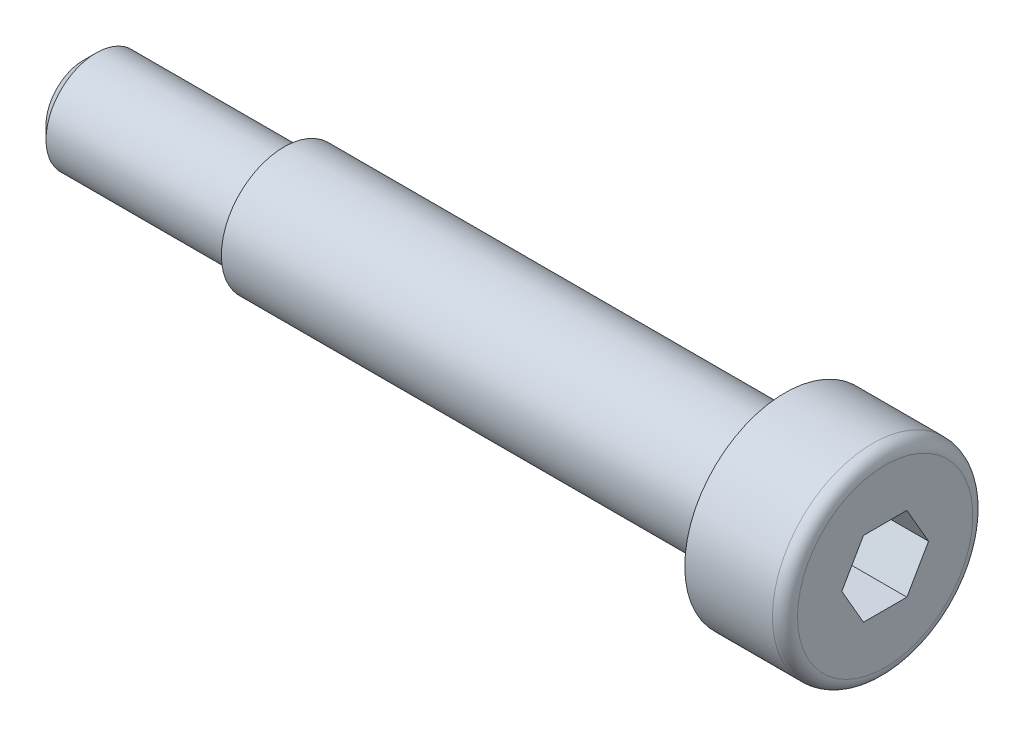
ISO-10303-21;
HEADER;
FILE_DESCRIPTION(('STEP AP214'),'2;1');
FILE_NAME('part.step','',(''),(''),'','','');
FILE_SCHEMA(('AUTOMOTIVE_DESIGN { 1 0 10303 214 1 1 1 1 }'));
ENDSEC;
DATA;
#1=APPLICATION_CONTEXT('core data for automotive mechanical design processes');
#2=APPLICATION_PROTOCOL_DEFINITION('international standard','automotive_design',2000,#1);
#3=PRODUCT_CONTEXT('',#1,'mechanical');
#4=PRODUCT('Part','Part','',(#3));
#5=PRODUCT_RELATED_PRODUCT_CATEGORY('part','',(#4));
#6=PRODUCT_DEFINITION_FORMATION('','',#4);
#7=PRODUCT_DEFINITION_CONTEXT('part definition',#1,'design');
#8=PRODUCT_DEFINITION('design','',#6,#7);
#9=PRODUCT_DEFINITION_SHAPE('','',#8);
#10=(LENGTH_UNIT() NAMED_UNIT(*) SI_UNIT(.MILLI.,.METRE.));
#11=(NAMED_UNIT(*) PLANE_ANGLE_UNIT() SI_UNIT($,.RADIAN.));
#12=(NAMED_UNIT(*) SI_UNIT($,.STERADIAN.) SOLID_ANGLE_UNIT());
#13=UNCERTAINTY_MEASURE_WITH_UNIT(LENGTH_MEASURE(1.E-05),#10,'distance_accuracy_value','');
#14=(GEOMETRIC_REPRESENTATION_CONTEXT(3) GLOBAL_UNCERTAINTY_ASSIGNED_CONTEXT((#13)) GLOBAL_UNIT_ASSIGNED_CONTEXT((#10,
#11,#12)) REPRESENTATION_CONTEXT('',''));
#15=CARTESIAN_POINT('',(0.,0.,0.));
#16=DIRECTION('',(0.,0.,1.));
#17=DIRECTION('',(1.,0.,0.));
#18=AXIS2_PLACEMENT_3D('',#15,#16,#17);
#19=CARTESIAN_POINT('',(0.,0.,0.));
#20=DIRECTION('',(-1.,0.,0.));
#21=DIRECTION('',(0.,0.,1.));
#22=AXIS2_PLACEMENT_3D('',#19,#20,#21);
#23=PLANE('',#22);
#24=DIRECTION('',(0.,0.866025403784439,0.5));
#25=VECTOR('',#24,1.);
#26=CARTESIAN_POINT('',(0.,0.,-1.73205080756888));
#27=LINE('',#26,#25);
#28=CARTESIAN_POINT('',(0.,0.,-1.73205080756888));
#29=VERTEX_POINT('',#28);
#30=CARTESIAN_POINT('',(0.,1.5,-0.866025403784438));
#31=VERTEX_POINT('',#30);
#32=EDGE_CURVE('E137',#29,#31,#27,.T.);
#33=ORIENTED_EDGE('',*,*,#32,.F.);
#34=DIRECTION('',(0.,0.866025403784439,-0.5));
#35=VECTOR('',#34,1.);
#36=CARTESIAN_POINT('',(0.,-1.5,-0.866025403784439));
#37=LINE('',#36,#35);
#38=CARTESIAN_POINT('',(0.,-1.5,-0.866025403784439));
#39=VERTEX_POINT('',#38);
#40=EDGE_CURVE('E57',#39,#29,#37,.T.);
#41=ORIENTED_EDGE('',*,*,#40,.F.);
#42=DIRECTION('',(0.,0.,-1.));
#43=VECTOR('',#42,1.);
#44=CARTESIAN_POINT('',(0.,-1.5,0.866025403784438));
#45=LINE('',#44,#43);
#46=CARTESIAN_POINT('',(0.,-1.5,0.866025403784438));
#47=VERTEX_POINT('',#46);
#48=EDGE_CURVE('E150',#47,#39,#45,.T.);
#49=ORIENTED_EDGE('',*,*,#48,.F.);
#50=DIRECTION('',(0.,-0.866025403784439,-0.5));
#51=VECTOR('',#50,1.);
#52=CARTESIAN_POINT('',(0.,0.,1.73205080756888));
#53=LINE('',#52,#51);
#54=CARTESIAN_POINT('',(0.,0.,1.73205080756888));
#55=VERTEX_POINT('',#54);
#56=EDGE_CURVE('E147',#55,#47,#53,.T.);
#57=ORIENTED_EDGE('',*,*,#56,.F.);
#58=DIRECTION('',(0.,-0.866025403784439,0.5));
#59=VECTOR('',#58,1.);
#60=CARTESIAN_POINT('',(0.,1.5,0.866025403784439));
#61=LINE('',#60,#59);
#62=CARTESIAN_POINT('',(0.,1.5,0.866025403784439));
#63=VERTEX_POINT('',#62);
#64=EDGE_CURVE('E105',#63,#55,#61,.T.);
#65=ORIENTED_EDGE('',*,*,#64,.F.);
#66=DIRECTION('',(0.,0.,1.));
#67=VECTOR('',#66,1.);
#68=CARTESIAN_POINT('',(0.,1.5,-0.866025403784438));
#69=LINE('',#68,#67);
#70=EDGE_CURVE('E141',#31,#63,#69,.T.);
#71=ORIENTED_EDGE('',*,*,#70,.F.);
#72=EDGE_LOOP('',(#33,#41,#49,#57,#65,#71));
#73=FACE_BOUND('',#72,.T.);
#74=CARTESIAN_POINT('',(0.,0.,0.));
#75=DIRECTION('',(-1.,0.,0.));
#76=DIRECTION('',(0.,0.,1.));
#77=AXIS2_PLACEMENT_3D('',#74,#75,#76);
#78=CIRCLE('',#77,3.5);
#79=CARTESIAN_POINT('',(0.,0.,3.5));
#80=VERTEX_POINT('',#79);
#81=EDGE_CURVE('E185',#80,#80,#78,.T.);
#82=ORIENTED_EDGE('',*,*,#81,.F.);
#83=EDGE_LOOP('',(#82));
#84=FACE_BOUND('',#83,.T.);
#85=ADVANCED_FACE('F41',(#73,#84),#23,.F.);
#86=CARTESIAN_POINT('',(-0.5,0.,0.));
#87=DIRECTION('',(-1.,0.,0.));
#88=DIRECTION('',(0.,0.,1.));
#89=AXIS2_PLACEMENT_3D('',#86,#87,#88);
#90=TOROIDAL_SURFACE('',#89,3.5,0.5);
#91=CARTESIAN_POINT('',(-0.5,0.,0.));
#92=DIRECTION('',(-1.,0.,0.));
#93=DIRECTION('',(0.,0.,1.));
#94=AXIS2_PLACEMENT_3D('',#91,#92,#93);
#95=CIRCLE('',#94,4.);
#96=CARTESIAN_POINT('',(-0.5,0.,4.));
#97=VERTEX_POINT('',#96);
#98=EDGE_CURVE('E181',#97,#97,#95,.T.);
#99=ORIENTED_EDGE('',*,*,#98,.F.);
#100=EDGE_LOOP('',(#99));
#101=FACE_BOUND('',#100,.T.);
#102=ORIENTED_EDGE('',*,*,#81,.T.);
#103=EDGE_LOOP('',(#102));
#104=FACE_BOUND('',#103,.T.);
#105=ADVANCED_FACE('F207',(#101,#104),#90,.T.);
#106=CARTESIAN_POINT('',(0.,0.,0.));
#107=DIRECTION('',(-1.,0.,0.));
#108=DIRECTION('',(0.,0.,1.));
#109=AXIS2_PLACEMENT_3D('',#106,#107,#108);
#110=CYLINDRICAL_SURFACE('',#109,4.);
#111=CARTESIAN_POINT('',(-4.,0.,0.));
#112=DIRECTION('',(-1.,0.,0.));
#113=DIRECTION('',(0.,0.,1.));
#114=AXIS2_PLACEMENT_3D('',#111,#112,#113);
#115=CIRCLE('',#114,4.);
#116=CARTESIAN_POINT('',(-4.,0.,4.));
#117=VERTEX_POINT('',#116);
#118=EDGE_CURVE('E177',#117,#117,#115,.T.);
#119=ORIENTED_EDGE('',*,*,#118,.F.);
#120=EDGE_LOOP('',(#119));
#121=FACE_BOUND('',#120,.T.);
#122=ORIENTED_EDGE('',*,*,#98,.T.);
#123=EDGE_LOOP('',(#122));
#124=FACE_BOUND('',#123,.T.);
#125=ADVANCED_FACE('F212',(#121,#124),#110,.T.);
#126=CARTESIAN_POINT('',(-4.,4.,0.));
#127=DIRECTION('',(1.,0.,0.));
#128=DIRECTION('',(0.,0.,-1.));
#129=AXIS2_PLACEMENT_3D('',#126,#127,#128);
#130=PLANE('',#129);
#131=CARTESIAN_POINT('',(-4.,0.,0.));
#132=DIRECTION('',(-1.,0.,0.));
#133=DIRECTION('',(0.,0.,1.));
#134=AXIS2_PLACEMENT_3D('',#131,#132,#133);
#135=CIRCLE('',#134,2.5);
#136=CARTESIAN_POINT('',(-4.,0.,2.5));
#137=VERTEX_POINT('',#136);
#138=EDGE_CURVE('E173',#137,#137,#135,.T.);
#139=ORIENTED_EDGE('',*,*,#138,.F.);
#140=EDGE_LOOP('',(#139));
#141=FACE_BOUND('',#140,.T.);
#142=ORIENTED_EDGE('',*,*,#118,.T.);
#143=EDGE_LOOP('',(#142));
#144=FACE_BOUND('',#143,.T.);
#145=ADVANCED_FACE('F220',(#141,#144),#130,.F.);
#146=CARTESIAN_POINT('',(0.,0.,0.));
#147=DIRECTION('',(-1.,0.,0.));
#148=DIRECTION('',(0.,0.,1.));
#149=AXIS2_PLACEMENT_3D('',#146,#147,#148);
#150=CYLINDRICAL_SURFACE('',#149,2.5);
#151=CARTESIAN_POINT('',(-24.,0.,0.));
#152=DIRECTION('',(-1.,0.,0.));
#153=DIRECTION('',(0.,0.,1.));
#154=AXIS2_PLACEMENT_3D('',#151,#152,#153);
#155=CIRCLE('',#154,2.5);
#156=CARTESIAN_POINT('',(-24.,0.,2.5));
#157=VERTEX_POINT('',#156);
#158=EDGE_CURVE('E169',#157,#157,#155,.T.);
#159=ORIENTED_EDGE('',*,*,#158,.F.);
#160=EDGE_LOOP('',(#159));
#161=FACE_BOUND('',#160,.T.);
#162=ORIENTED_EDGE('',*,*,#138,.T.);
#163=EDGE_LOOP('',(#162));
#164=FACE_BOUND('',#163,.T.);
#165=ADVANCED_FACE('F224',(#161,#164),#150,.T.);
#166=CARTESIAN_POINT('',(-24.,2.5,0.));
#167=DIRECTION('',(1.,0.,0.));
#168=DIRECTION('',(0.,0.,-1.));
#169=AXIS2_PLACEMENT_3D('',#166,#167,#168);
#170=PLANE('',#169);
#171=CARTESIAN_POINT('',(-24.,0.,0.));
#172=DIRECTION('',(-1.,0.,0.));
#173=DIRECTION('',(0.,0.,1.));
#174=AXIS2_PLACEMENT_3D('',#171,#172,#173);
#175=CIRCLE('',#174,2.);
#176=CARTESIAN_POINT('',(-24.,0.,2.));
#177=VERTEX_POINT('',#176);
#178=EDGE_CURVE('E156',#177,#177,#175,.T.);
#179=ORIENTED_EDGE('',*,*,#178,.F.);
#180=EDGE_LOOP('',(#179));
#181=FACE_BOUND('',#180,.T.);
#182=ORIENTED_EDGE('',*,*,#158,.T.);
#183=EDGE_LOOP('',(#182));
#184=FACE_BOUND('',#183,.T.);
#185=ADVANCED_FACE('F228',(#181,#184),#170,.F.);
#186=CARTESIAN_POINT('',(0.,0.,0.));
#187=DIRECTION('',(-1.,0.,0.));
#188=DIRECTION('',(0.,0.,1.));
#189=AXIS2_PLACEMENT_3D('',#186,#187,#188);
#190=CYLINDRICAL_SURFACE('',#189,2.);
#191=CARTESIAN_POINT('',(-31.5,0.,0.));
#192=DIRECTION('',(1.,0.,0.));
#193=DIRECTION('',(0.,0.,-1.));
#194=AXIS2_PLACEMENT_3D('',#191,#192,#193);
#195=CIRCLE('',#194,2.);
#196=CARTESIAN_POINT('',(-31.5,0.,-2.));
#197=VERTEX_POINT('',#196);
#198=EDGE_CURVE('E11',#197,#197,#195,.T.);
#199=ORIENTED_EDGE('',*,*,#198,.T.);
#200=EDGE_LOOP('',(#199));
#201=FACE_BOUND('',#200,.T.);
#202=ORIENTED_EDGE('',*,*,#178,.T.);
#203=EDGE_LOOP('',(#202));
#204=FACE_BOUND('',#203,.T.);
#205=ADVANCED_FACE('F203',(#201,#204),#190,.T.);
#206=CARTESIAN_POINT('',(-32.,2.,0.));
#207=DIRECTION('',(1.,0.,0.));
#208=DIRECTION('',(0.,0.,-1.));
#209=AXIS2_PLACEMENT_3D('',#206,#207,#208);
#210=PLANE('',#209);
#211=CARTESIAN_POINT('',(-32.,0.,0.));
#212=DIRECTION('',(1.,0.,0.));
#213=DIRECTION('',(0.,0.,-1.));
#214=AXIS2_PLACEMENT_3D('',#211,#212,#213);
#215=CIRCLE('',#214,1.5);
#216=CARTESIAN_POINT('',(-32.,0.,-1.5));
#217=VERTEX_POINT('',#216);
#218=EDGE_CURVE('E50',#217,#217,#215,.F.);
#219=ORIENTED_EDGE('',*,*,#218,.T.);
#220=EDGE_LOOP('',(#219));
#221=FACE_BOUND('',#220,.T.);
#222=ADVANCED_FACE('F192',(#221),#210,.F.);
#223=CARTESIAN_POINT('',(-32.,0.,0.));
#224=DIRECTION('',(1.,0.,0.));
#225=DIRECTION('',(0.,0.,-1.));
#226=AXIS2_PLACEMENT_3D('',#223,#224,#225);
#227=CONICAL_SURFACE('',#226,1.5,0.785398163397439);
#228=ORIENTED_EDGE('',*,*,#198,.F.);
#229=EDGE_LOOP('',(#228));
#230=FACE_BOUND('',#229,.T.);
#231=ORIENTED_EDGE('',*,*,#218,.F.);
#232=EDGE_LOOP('',(#231));
#233=FACE_BOUND('',#232,.T.);
#234=ADVANCED_FACE('F43',(#230,#233),#227,.T.);
#235=CARTESIAN_POINT('',(-2.4,-1.5,-0.866025403784439));
#236=DIRECTION('',(0.,-0.5,-0.866025403784439));
#237=DIRECTION('',(0.,0.866025403784439,-0.5));
#238=AXIS2_PLACEMENT_3D('',#235,#236,#237);
#239=PLANE('',#238);
#240=ORIENTED_EDGE('',*,*,#40,.T.);
#241=DIRECTION('',(1.,0.,0.));
#242=VECTOR('',#241,1.);
#243=CARTESIAN_POINT('',(-2.4,0.,-1.73205080756888));
#244=LINE('',#243,#242);
#245=CARTESIAN_POINT('',(-2.4,0.,-1.73205080756888));
#246=VERTEX_POINT('',#245);
#247=EDGE_CURVE('E87',#246,#29,#244,.T.);
#248=ORIENTED_EDGE('',*,*,#247,.F.);
#249=DIRECTION('',(0.,0.866025403784439,-0.5));
#250=VECTOR('',#249,1.);
#251=CARTESIAN_POINT('',(-2.4,-1.5,-0.866025403784439));
#252=LINE('',#251,#250);
#253=CARTESIAN_POINT('',(-2.4,-1.5,-0.866025403784439));
#254=VERTEX_POINT('',#253);
#255=EDGE_CURVE('E153',#254,#246,#252,.T.);
#256=ORIENTED_EDGE('',*,*,#255,.F.);
#257=DIRECTION('',(1.,0.,0.));
#258=VECTOR('',#257,1.);
#259=CARTESIAN_POINT('',(-2.4,-1.5,-0.866025403784439));
#260=LINE('',#259,#258);
#261=EDGE_CURVE('E65',#254,#39,#260,.T.);
#262=ORIENTED_EDGE('',*,*,#261,.T.);
#263=EDGE_LOOP('',(#240,#248,#256,#262));
#264=FACE_BOUND('',#263,.T.);
#265=ADVANCED_FACE('F195',(#264),#239,.F.);
#266=CARTESIAN_POINT('',(-2.4,-1.5,0.866025403784438));
#267=DIRECTION('',(0.,-1.,0.));
#268=DIRECTION('',(0.,0.,-1.));
#269=AXIS2_PLACEMENT_3D('',#266,#267,#268);
#270=PLANE('',#269);
#271=ORIENTED_EDGE('',*,*,#48,.T.);
#272=ORIENTED_EDGE('',*,*,#261,.F.);
#273=DIRECTION('',(0.,0.,-1.));
#274=VECTOR('',#273,1.);
#275=CARTESIAN_POINT('',(-2.4,-1.5,0.866025403784438));
#276=LINE('',#275,#274);
#277=CARTESIAN_POINT('',(-2.4,-1.5,0.866025403784438));
#278=VERTEX_POINT('',#277);
#279=EDGE_CURVE('E119',#278,#254,#276,.T.);
#280=ORIENTED_EDGE('',*,*,#279,.F.);
#281=DIRECTION('',(1.,0.,0.));
#282=VECTOR('',#281,1.);
#283=CARTESIAN_POINT('',(-2.4,-1.5,0.866025403784438));
#284=LINE('',#283,#282);
#285=EDGE_CURVE('E110',#278,#47,#284,.T.);
#286=ORIENTED_EDGE('',*,*,#285,.T.);
#287=EDGE_LOOP('',(#271,#272,#280,#286));
#288=FACE_BOUND('',#287,.T.);
#289=ADVANCED_FACE('F201',(#288),#270,.F.);
#290=CARTESIAN_POINT('',(-2.4,0.,1.73205080756888));
#291=DIRECTION('',(0.,-0.5,0.866025403784439));
#292=DIRECTION('',(0.,-0.866025403784439,-0.5));
#293=AXIS2_PLACEMENT_3D('',#290,#291,#292);
#294=PLANE('',#293);
#295=ORIENTED_EDGE('',*,*,#56,.T.);
#296=ORIENTED_EDGE('',*,*,#285,.F.);
#297=DIRECTION('',(0.,-0.866025403784439,-0.5));
#298=VECTOR('',#297,1.);
#299=CARTESIAN_POINT('',(-2.4,0.,1.73205080756888));
#300=LINE('',#299,#298);
#301=CARTESIAN_POINT('',(-2.4,0.,1.73205080756888));
#302=VERTEX_POINT('',#301);
#303=EDGE_CURVE('E114',#302,#278,#300,.T.);
#304=ORIENTED_EDGE('',*,*,#303,.F.);
#305=DIRECTION('',(1.,0.,0.));
#306=VECTOR('',#305,1.);
#307=CARTESIAN_POINT('',(-2.4,0.,1.73205080756888));
#308=LINE('',#307,#306);
#309=EDGE_CURVE('E98',#302,#55,#308,.T.);
#310=ORIENTED_EDGE('',*,*,#309,.T.);
#311=EDGE_LOOP('',(#295,#296,#304,#310));
#312=FACE_BOUND('',#311,.T.);
#313=ADVANCED_FACE('F115',(#312),#294,.F.);
#314=CARTESIAN_POINT('',(-2.4,1.5,0.866025403784439));
#315=DIRECTION('',(0.,0.5,0.866025403784439));
#316=DIRECTION('',(0.,-0.866025403784439,0.5));
#317=AXIS2_PLACEMENT_3D('',#314,#315,#316);
#318=PLANE('',#317);
#319=ORIENTED_EDGE('',*,*,#64,.T.);
#320=ORIENTED_EDGE('',*,*,#309,.F.);
#321=DIRECTION('',(0.,-0.866025403784439,0.5));
#322=VECTOR('',#321,1.);
#323=CARTESIAN_POINT('',(-2.4,1.5,0.866025403784439));
#324=LINE('',#323,#322);
#325=CARTESIAN_POINT('',(-2.4,1.5,0.866025403784439));
#326=VERTEX_POINT('',#325);
#327=EDGE_CURVE('E102',#326,#302,#324,.T.);
#328=ORIENTED_EDGE('',*,*,#327,.F.);
#329=DIRECTION('',(1.,0.,0.));
#330=VECTOR('',#329,1.);
#331=CARTESIAN_POINT('',(-2.4,1.5,0.866025403784439));
#332=LINE('',#331,#330);
#333=EDGE_CURVE('E111',#326,#63,#332,.T.);
#334=ORIENTED_EDGE('',*,*,#333,.T.);
#335=EDGE_LOOP('',(#319,#320,#328,#334));
#336=FACE_BOUND('',#335,.T.);
#337=ADVANCED_FACE('F100',(#336),#318,.F.);
#338=CARTESIAN_POINT('',(-2.4,1.5,-0.866025403784438));
#339=DIRECTION('',(0.,1.,0.));
#340=DIRECTION('',(0.,0.,1.));
#341=AXIS2_PLACEMENT_3D('',#338,#339,#340);
#342=PLANE('',#341);
#343=ORIENTED_EDGE('',*,*,#70,.T.);
#344=ORIENTED_EDGE('',*,*,#333,.F.);
#345=DIRECTION('',(0.,0.,1.));
#346=VECTOR('',#345,1.);
#347=CARTESIAN_POINT('',(-2.4,1.5,-0.866025403784438));
#348=LINE('',#347,#346);
#349=CARTESIAN_POINT('',(-2.4,1.5,-0.866025403784438));
#350=VERTEX_POINT('',#349);
#351=EDGE_CURVE('E125',#350,#326,#348,.T.);
#352=ORIENTED_EDGE('',*,*,#351,.F.);
#353=DIRECTION('',(1.,0.,0.));
#354=VECTOR('',#353,1.);
#355=CARTESIAN_POINT('',(-2.4,1.5,-0.866025403784438));
#356=LINE('',#355,#354);
#357=EDGE_CURVE('E161',#350,#31,#356,.T.);
#358=ORIENTED_EDGE('',*,*,#357,.T.);
#359=EDGE_LOOP('',(#343,#344,#352,#358));
#360=FACE_BOUND('',#359,.T.);
#361=ADVANCED_FACE('F239',(#360),#342,.F.);
#362=CARTESIAN_POINT('',(-2.4,0.,-1.73205080756888));
#363=DIRECTION('',(0.,0.5,-0.866025403784438));
#364=DIRECTION('',(0.,0.866025403784439,0.5));
#365=AXIS2_PLACEMENT_3D('',#362,#363,#364);
#366=PLANE('',#365);
#367=ORIENTED_EDGE('',*,*,#32,.T.);
#368=ORIENTED_EDGE('',*,*,#357,.F.);
#369=DIRECTION('',(0.,0.866025403784439,0.5));
#370=VECTOR('',#369,1.);
#371=CARTESIAN_POINT('',(-2.4,0.,-1.73205080756888));
#372=LINE('',#371,#370);
#373=EDGE_CURVE('E129',#246,#350,#372,.T.);
#374=ORIENTED_EDGE('',*,*,#373,.F.);
#375=ORIENTED_EDGE('',*,*,#247,.T.);
#376=EDGE_LOOP('',(#367,#368,#374,#375));
#377=FACE_BOUND('',#376,.T.);
#378=ADVANCED_FACE('F236',(#377),#366,.F.);
#379=CARTESIAN_POINT('',(-2.4,0.,0.));
#380=DIRECTION('',(1.,0.,0.));
#381=DIRECTION('',(0.,0.,-1.));
#382=AXIS2_PLACEMENT_3D('',#379,#380,#381);
#383=PLANE('',#382);
#384=ORIENTED_EDGE('',*,*,#255,.T.);
#385=ORIENTED_EDGE('',*,*,#373,.T.);
#386=ORIENTED_EDGE('',*,*,#351,.T.);
#387=ORIENTED_EDGE('',*,*,#327,.T.);
#388=ORIENTED_EDGE('',*,*,#303,.T.);
#389=ORIENTED_EDGE('',*,*,#279,.T.);
#390=EDGE_LOOP('',(#384,#385,#386,#387,#388,#389));
#391=FACE_BOUND('',#390,.T.);
#392=ADVANCED_FACE('F122',(#391),#383,.T.);
#393=CLOSED_SHELL('',(#85,#105,#125,#145,#165,#185,#205,#222,#234,#265,#289,#313,#337,#361,#378,#392));
#394=MANIFOLD_SOLID_BREP('B2',#393);
#395=ADVANCED_BREP_SHAPE_REPRESENTATION('',(#18,#394),#14);
#396=SHAPE_DEFINITION_REPRESENTATION(#9,#395);
ENDSEC;
END-ISO-10303-21;
